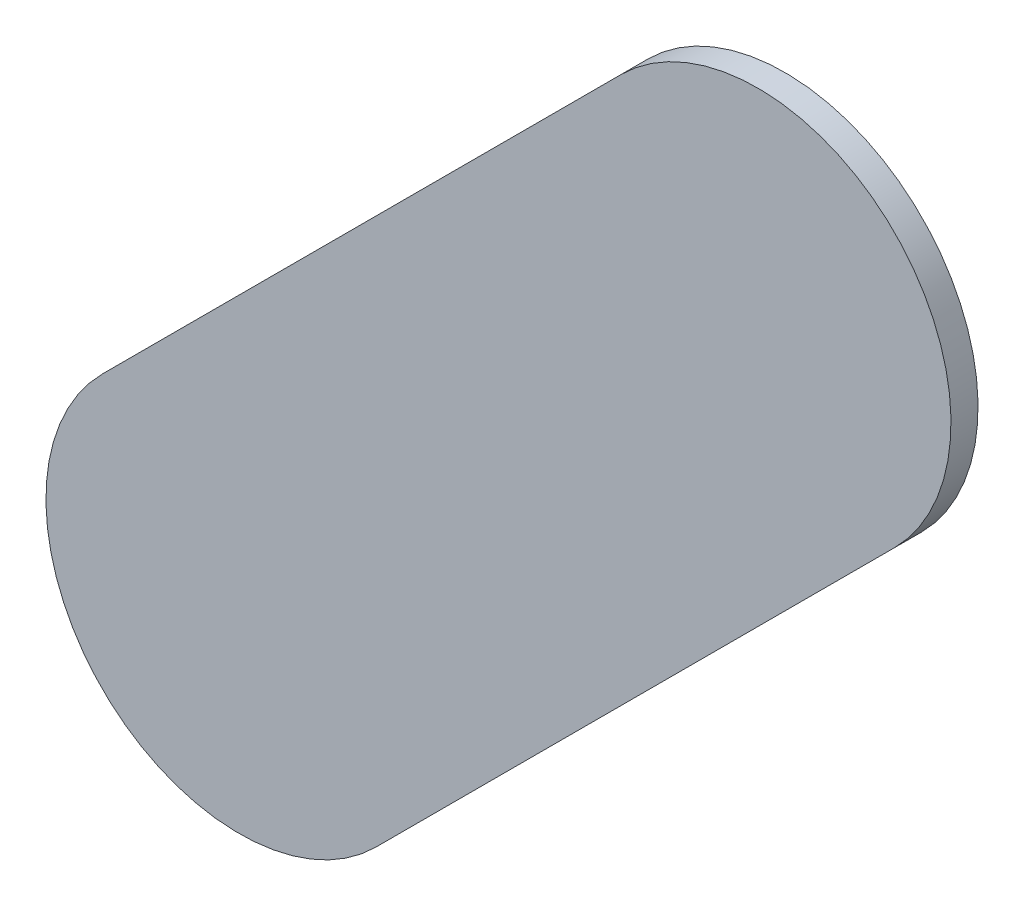
ISO-10303-21;
HEADER;
FILE_DESCRIPTION(('STEP AP214'),'2;1');
FILE_NAME('part.step','',(''),(''),'','','');
FILE_SCHEMA(('AUTOMOTIVE_DESIGN { 1 0 10303 214 1 1 1 1 }'));
ENDSEC;
DATA;
#1=APPLICATION_CONTEXT('core data for automotive mechanical design processes');
#2=APPLICATION_PROTOCOL_DEFINITION('international standard','automotive_design',2000,#1);
#3=PRODUCT_CONTEXT('',#1,'mechanical');
#4=PRODUCT('Part','Part','',(#3));
#5=PRODUCT_RELATED_PRODUCT_CATEGORY('part','',(#4));
#6=PRODUCT_DEFINITION_FORMATION('','',#4);
#7=PRODUCT_DEFINITION_CONTEXT('part definition',#1,'design');
#8=PRODUCT_DEFINITION('design','',#6,#7);
#9=PRODUCT_DEFINITION_SHAPE('','',#8);
#10=(LENGTH_UNIT() NAMED_UNIT(*) SI_UNIT(.MILLI.,.METRE.));
#11=(NAMED_UNIT(*) PLANE_ANGLE_UNIT() SI_UNIT($,.RADIAN.));
#12=(NAMED_UNIT(*) SI_UNIT($,.STERADIAN.) SOLID_ANGLE_UNIT());
#13=UNCERTAINTY_MEASURE_WITH_UNIT(LENGTH_MEASURE(1.E-05),#10,'distance_accuracy_value','');
#14=(GEOMETRIC_REPRESENTATION_CONTEXT(3) GLOBAL_UNCERTAINTY_ASSIGNED_CONTEXT((#13)) GLOBAL_UNIT_ASSIGNED_CONTEXT((#10,
#11,#12)) REPRESENTATION_CONTEXT('',''));
#15=CARTESIAN_POINT('',(0.,0.,0.));
#16=DIRECTION('',(0.,0.,1.));
#17=DIRECTION('',(1.,0.,0.));
#18=AXIS2_PLACEMENT_3D('',#15,#16,#17);
#19=CARTESIAN_POINT('',(178.956776,-122.132776,0.));
#20=DIRECTION('',(0.,0.,1.));
#21=DIRECTION('',(1.,0.,0.));
#22=AXIS2_PLACEMENT_3D('',#19,#20,#21);
#23=PLANE('',#22);
#24=DIRECTION('',(0.707106781186548,0.707106781186548,0.));
#25=VECTOR('',#24,1.);
#26=CARTESIAN_POINT('',(178.956776,-122.132776,0.));
#27=LINE('',#26,#25);
#28=CARTESIAN_POINT('',(178.956776,-122.132776,0.));
#29=VERTEX_POINT('',#28);
#30=CARTESIAN_POINT('',(179.627776,-121.461776,0.));
#31=VERTEX_POINT('',#30);
#32=EDGE_CURVE('E82',#29,#31,#27,.T.);
#33=ORIENTED_EDGE('',*,*,#32,.T.);
#34=CARTESIAN_POINT('',(179.4509995,-121.2849995,0.));
#35=DIRECTION('',(0.,0.,1.));
#36=DIRECTION('',(0.707106781186548,-0.707106781186548,0.));
#37=AXIS2_PLACEMENT_3D('',#34,#35,#36);
#38=CIRCLE('',#37,0.249999723809);
#39=CARTESIAN_POINT('',(179.274223,-121.108223,0.));
#40=VERTEX_POINT('',#39);
#41=EDGE_CURVE('E105',#31,#40,#38,.T.);
#42=ORIENTED_EDGE('',*,*,#41,.T.);
#43=DIRECTION('',(-0.707106781186548,-0.707106781186548,0.));
#44=VECTOR('',#43,1.);
#45=CARTESIAN_POINT('',(179.274223,-121.108223,0.));
#46=LINE('',#45,#44);
#47=CARTESIAN_POINT('',(178.603223,-121.779223,0.));
#48=VERTEX_POINT('',#47);
#49=EDGE_CURVE('E75',#40,#48,#46,.T.);
#50=ORIENTED_EDGE('',*,*,#49,.T.);
#51=CARTESIAN_POINT('',(178.7799995,-121.9559995,0.));
#52=DIRECTION('',(0.,0.,1.));
#53=DIRECTION('',(-0.707106781186548,0.707106781186548,0.));
#54=AXIS2_PLACEMENT_3D('',#51,#52,#53);
#55=CIRCLE('',#54,0.249999723809);
#56=EDGE_CURVE('E11',#48,#29,#55,.T.);
#57=ORIENTED_EDGE('',*,*,#56,.T.);
#58=EDGE_LOOP('',(#33,#42,#50,#57));
#59=FACE_BOUND('',#58,.T.);
#60=ADVANCED_FACE('F17',(#59),#23,.T.);
#61=CARTESIAN_POINT('',(178.956776,-122.132776,-0.035));
#62=DIRECTION('',(0.,0.,1.));
#63=DIRECTION('',(1.,0.,0.));
#64=AXIS2_PLACEMENT_3D('',#61,#62,#63);
#65=PLANE('',#64);
#66=CARTESIAN_POINT('',(178.7799995,-121.9559995,-0.035));
#67=DIRECTION('',(0.,0.,1.));
#68=DIRECTION('',(-0.707106781186548,0.707106781186548,0.));
#69=AXIS2_PLACEMENT_3D('',#66,#67,#68);
#70=CIRCLE('',#69,0.249999723809);
#71=CARTESIAN_POINT('',(178.603223,-121.779223,-0.035));
#72=VERTEX_POINT('',#71);
#73=CARTESIAN_POINT('',(178.956776,-122.132776,-0.035));
#74=VERTEX_POINT('',#73);
#75=EDGE_CURVE('E21',#72,#74,#70,.T.);
#76=ORIENTED_EDGE('',*,*,#75,.F.);
#77=DIRECTION('',(-0.707106781186548,-0.707106781186548,0.));
#78=VECTOR('',#77,1.);
#79=CARTESIAN_POINT('',(179.274223,-121.108223,-0.035));
#80=LINE('',#79,#78);
#81=CARTESIAN_POINT('',(179.274223,-121.108223,-0.035));
#82=VERTEX_POINT('',#81);
#83=EDGE_CURVE('E109',#82,#72,#80,.T.);
#84=ORIENTED_EDGE('',*,*,#83,.F.);
#85=CARTESIAN_POINT('',(179.4509995,-121.2849995,-0.035));
#86=DIRECTION('',(0.,0.,1.));
#87=DIRECTION('',(0.707106781186548,-0.707106781186548,0.));
#88=AXIS2_PLACEMENT_3D('',#85,#86,#87);
#89=CIRCLE('',#88,0.249999723809);
#90=CARTESIAN_POINT('',(179.627776,-121.461776,-0.035));
#91=VERTEX_POINT('',#90);
#92=EDGE_CURVE('E84',#91,#82,#89,.T.);
#93=ORIENTED_EDGE('',*,*,#92,.F.);
#94=DIRECTION('',(0.707106781186548,0.707106781186548,0.));
#95=VECTOR('',#94,1.);
#96=CARTESIAN_POINT('',(178.956776,-122.132776,-0.035));
#97=LINE('',#96,#95);
#98=EDGE_CURVE('E80',#74,#91,#97,.T.);
#99=ORIENTED_EDGE('',*,*,#98,.F.);
#100=EDGE_LOOP('',(#76,#84,#93,#99));
#101=FACE_BOUND('',#100,.T.);
#102=ADVANCED_FACE('F19',(#101),#65,.F.);
#103=CARTESIAN_POINT('',(178.7799995,-121.9559995,-0.035));
#104=DIRECTION('',(0.,0.,-1.));
#105=DIRECTION('',(-0.707106781186548,0.707106781186548,0.));
#106=AXIS2_PLACEMENT_3D('',#103,#104,#105);
#107=CYLINDRICAL_SURFACE('',#106,0.249999723809);
#108=ORIENTED_EDGE('',*,*,#75,.T.);
#109=DIRECTION('',(0.,0.,1.));
#110=VECTOR('',#109,1.);
#111=CARTESIAN_POINT('',(178.956776,-122.132776,-0.035));
#112=LINE('',#111,#110);
#113=EDGE_CURVE('E69',#74,#29,#112,.T.);
#114=ORIENTED_EDGE('',*,*,#113,.T.);
#115=ORIENTED_EDGE('',*,*,#56,.F.);
#116=DIRECTION('',(0.,0.,1.));
#117=VECTOR('',#116,1.);
#118=CARTESIAN_POINT('',(178.603223,-121.779223,-0.035));
#119=LINE('',#118,#117);
#120=EDGE_CURVE('E72',#72,#48,#119,.T.);
#121=ORIENTED_EDGE('',*,*,#120,.F.);
#122=EDGE_LOOP('',(#108,#114,#115,#121));
#123=FACE_BOUND('',#122,.T.);
#124=ADVANCED_FACE('F68',(#123),#107,.T.);
#125=CARTESIAN_POINT('',(179.274223,-121.108223,-0.035));
#126=DIRECTION('',(0.707106781186548,-0.707106781186548,0.));
#127=DIRECTION('',(0.,0.,-1.));
#128=AXIS2_PLACEMENT_3D('',#125,#126,#127);
#129=PLANE('',#128);
#130=ORIENTED_EDGE('',*,*,#83,.T.);
#131=ORIENTED_EDGE('',*,*,#120,.T.);
#132=ORIENTED_EDGE('',*,*,#49,.F.);
#133=DIRECTION('',(0.,0.,1.));
#134=VECTOR('',#133,1.);
#135=CARTESIAN_POINT('',(179.274223,-121.108223,-0.035));
#136=LINE('',#135,#134);
#137=EDGE_CURVE('E100',#82,#40,#136,.T.);
#138=ORIENTED_EDGE('',*,*,#137,.F.);
#139=EDGE_LOOP('',(#130,#131,#132,#138));
#140=FACE_BOUND('',#139,.T.);
#141=ADVANCED_FACE('F119',(#140),#129,.F.);
#142=CARTESIAN_POINT('',(179.4509995,-121.2849995,-0.035));
#143=DIRECTION('',(0.,0.,-1.));
#144=DIRECTION('',(0.707106781186548,-0.707106781186548,0.));
#145=AXIS2_PLACEMENT_3D('',#142,#143,#144);
#146=CYLINDRICAL_SURFACE('',#145,0.249999723809);
#147=ORIENTED_EDGE('',*,*,#92,.T.);
#148=ORIENTED_EDGE('',*,*,#137,.T.);
#149=ORIENTED_EDGE('',*,*,#41,.F.);
#150=DIRECTION('',(0.,0.,1.));
#151=VECTOR('',#150,1.);
#152=CARTESIAN_POINT('',(179.627776,-121.461776,-0.035));
#153=LINE('',#152,#151);
#154=EDGE_CURVE('E89',#91,#31,#153,.T.);
#155=ORIENTED_EDGE('',*,*,#154,.F.);
#156=EDGE_LOOP('',(#147,#148,#149,#155));
#157=FACE_BOUND('',#156,.T.);
#158=ADVANCED_FACE('F121',(#157),#146,.T.);
#159=CARTESIAN_POINT('',(178.956776,-122.132776,-0.035));
#160=DIRECTION('',(-0.707106781186548,0.707106781186548,0.));
#161=DIRECTION('',(0.,0.,1.));
#162=AXIS2_PLACEMENT_3D('',#159,#160,#161);
#163=PLANE('',#162);
#164=ORIENTED_EDGE('',*,*,#98,.T.);
#165=ORIENTED_EDGE('',*,*,#154,.T.);
#166=ORIENTED_EDGE('',*,*,#32,.F.);
#167=ORIENTED_EDGE('',*,*,#113,.F.);
#168=EDGE_LOOP('',(#164,#165,#166,#167));
#169=FACE_BOUND('',#168,.T.);
#170=ADVANCED_FACE('F78',(#169),#163,.F.);
#171=CLOSED_SHELL('',(#60,#102,#124,#141,#158,#170));
#172=MANIFOLD_SOLID_BREP('B1',#171);
#173=ADVANCED_BREP_SHAPE_REPRESENTATION('',(#18,#172),#14);
#174=SHAPE_DEFINITION_REPRESENTATION(#9,#173);
ENDSEC;
END-ISO-10303-21;
